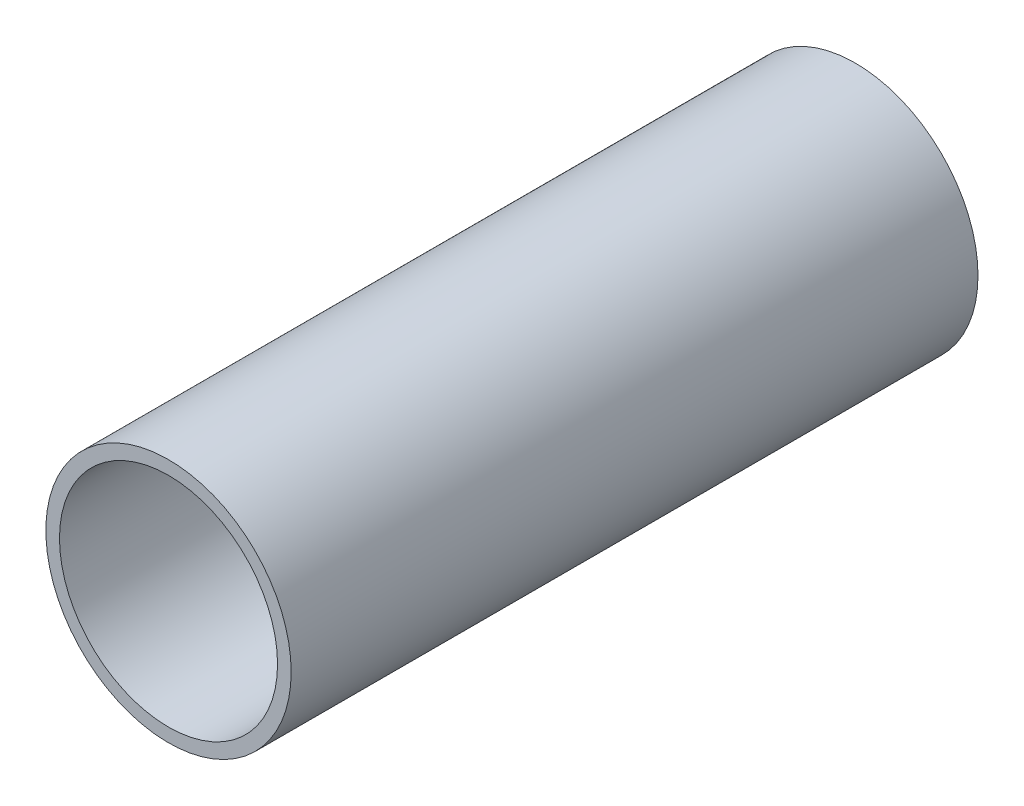
ISO-10303-21;
HEADER;
FILE_DESCRIPTION(('STEP AP214'),'2;1');
FILE_NAME('part.step','',(''),(''),'','','');
FILE_SCHEMA(('AUTOMOTIVE_DESIGN { 1 0 10303 214 1 1 1 1 }'));
ENDSEC;
DATA;
#1=APPLICATION_CONTEXT('core data for automotive mechanical design processes');
#2=APPLICATION_PROTOCOL_DEFINITION('international standard','automotive_design',2000,#1);
#3=PRODUCT_CONTEXT('',#1,'mechanical');
#4=PRODUCT('Part','Part','',(#3));
#5=PRODUCT_RELATED_PRODUCT_CATEGORY('part','',(#4));
#6=PRODUCT_DEFINITION_FORMATION('','',#4);
#7=PRODUCT_DEFINITION_CONTEXT('part definition',#1,'design');
#8=PRODUCT_DEFINITION('design','',#6,#7);
#9=PRODUCT_DEFINITION_SHAPE('','',#8);
#10=(LENGTH_UNIT() NAMED_UNIT(*) SI_UNIT(.MILLI.,.METRE.));
#11=(NAMED_UNIT(*) PLANE_ANGLE_UNIT() SI_UNIT($,.RADIAN.));
#12=(NAMED_UNIT(*) SI_UNIT($,.STERADIAN.) SOLID_ANGLE_UNIT());
#13=UNCERTAINTY_MEASURE_WITH_UNIT(LENGTH_MEASURE(1.E-05),#10,'distance_accuracy_value','');
#14=(GEOMETRIC_REPRESENTATION_CONTEXT(3) GLOBAL_UNCERTAINTY_ASSIGNED_CONTEXT((#13)) GLOBAL_UNIT_ASSIGNED_CONTEXT((#10,
#11,#12)) REPRESENTATION_CONTEXT('',''));
#15=CARTESIAN_POINT('',(0.,0.,0.));
#16=DIRECTION('',(0.,0.,1.));
#17=DIRECTION('',(1.,0.,0.));
#18=AXIS2_PLACEMENT_3D('',#15,#16,#17);
#19=CARTESIAN_POINT('',(0.,0.,80.));
#20=DIRECTION('',(0.,0.,1.));
#21=DIRECTION('',(1.,0.,0.));
#22=AXIS2_PLACEMENT_3D('',#19,#20,#21);
#23=PLANE('',#22);
#24=CARTESIAN_POINT('',(0.,0.,80.));
#25=DIRECTION('',(0.,0.,1.));
#26=DIRECTION('',(1.,0.,0.));
#27=AXIS2_PLACEMENT_3D('',#24,#25,#26);
#28=CIRCLE('',#27,28.575);
#29=CARTESIAN_POINT('',(28.575,0.,80.));
#30=VERTEX_POINT('',#29);
#31=EDGE_CURVE('E10',#30,#30,#28,.T.);
#32=ORIENTED_EDGE('',*,*,#31,.T.);
#33=EDGE_LOOP('',(#32));
#34=FACE_BOUND('',#33,.T.);
#35=CARTESIAN_POINT('',(0.,0.,80.));
#36=DIRECTION('',(0.,0.,1.));
#37=DIRECTION('',(1.,0.,0.));
#38=AXIS2_PLACEMENT_3D('',#35,#36,#37);
#39=CIRCLE('',#38,25.4);
#40=CARTESIAN_POINT('',(25.4,0.,80.));
#41=VERTEX_POINT('',#40);
#42=EDGE_CURVE('E41',#41,#41,#39,.T.);
#43=ORIENTED_EDGE('',*,*,#42,.F.);
#44=EDGE_LOOP('',(#43));
#45=FACE_BOUND('',#44,.T.);
#46=ADVANCED_FACE('F30',(#34,#45),#23,.T.);
#47=CARTESIAN_POINT('',(0.,0.,-80.));
#48=DIRECTION('',(0.,0.,1.));
#49=DIRECTION('',(1.,0.,0.));
#50=AXIS2_PLACEMENT_3D('',#47,#48,#49);
#51=PLANE('',#50);
#52=CARTESIAN_POINT('',(0.,0.,-80.));
#53=DIRECTION('',(0.,0.,1.));
#54=DIRECTION('',(1.,0.,0.));
#55=AXIS2_PLACEMENT_3D('',#52,#53,#54);
#56=CIRCLE('',#55,28.575);
#57=CARTESIAN_POINT('',(28.575,0.,-80.));
#58=VERTEX_POINT('',#57);
#59=EDGE_CURVE('E34',#58,#58,#56,.T.);
#60=ORIENTED_EDGE('',*,*,#59,.F.);
#61=EDGE_LOOP('',(#60));
#62=FACE_BOUND('',#61,.T.);
#63=CARTESIAN_POINT('',(0.,0.,-80.));
#64=DIRECTION('',(0.,0.,1.));
#65=DIRECTION('',(1.,0.,0.));
#66=AXIS2_PLACEMENT_3D('',#63,#64,#65);
#67=CIRCLE('',#66,25.4);
#68=CARTESIAN_POINT('',(25.4,0.,-80.));
#69=VERTEX_POINT('',#68);
#70=EDGE_CURVE('E43',#69,#69,#67,.T.);
#71=ORIENTED_EDGE('',*,*,#70,.T.);
#72=EDGE_LOOP('',(#71));
#73=FACE_BOUND('',#72,.T.);
#74=ADVANCED_FACE('F53',(#62,#73),#51,.F.);
#75=CARTESIAN_POINT('',(0.,0.,80.));
#76=DIRECTION('',(0.,0.,-1.));
#77=DIRECTION('',(-1.,0.,0.));
#78=AXIS2_PLACEMENT_3D('',#75,#76,#77);
#79=CYLINDRICAL_SURFACE('',#78,28.575);
#80=ORIENTED_EDGE('',*,*,#31,.F.);
#81=EDGE_LOOP('',(#80));
#82=FACE_BOUND('',#81,.T.);
#83=ORIENTED_EDGE('',*,*,#59,.T.);
#84=EDGE_LOOP('',(#83));
#85=FACE_BOUND('',#84,.T.);
#86=ADVANCED_FACE('F32',(#82,#85),#79,.T.);
#87=CARTESIAN_POINT('',(0.,0.,80.));
#88=DIRECTION('',(0.,0.,-1.));
#89=DIRECTION('',(-1.,0.,0.));
#90=AXIS2_PLACEMENT_3D('',#87,#88,#89);
#91=CYLINDRICAL_SURFACE('',#90,25.4);
#92=ORIENTED_EDGE('',*,*,#42,.T.);
#93=EDGE_LOOP('',(#92));
#94=FACE_BOUND('',#93,.T.);
#95=ORIENTED_EDGE('',*,*,#70,.F.);
#96=EDGE_LOOP('',(#95));
#97=FACE_BOUND('',#96,.T.);
#98=ADVANCED_FACE('F49',(#94,#97),#91,.F.);
#99=CLOSED_SHELL('',(#46,#74,#86,#98));
#100=MANIFOLD_SOLID_BREP('B2',#99);
#101=ADVANCED_BREP_SHAPE_REPRESENTATION('',(#18,#100),#14);
#102=SHAPE_DEFINITION_REPRESENTATION(#9,#101);
ENDSEC;
END-ISO-10303-21;
